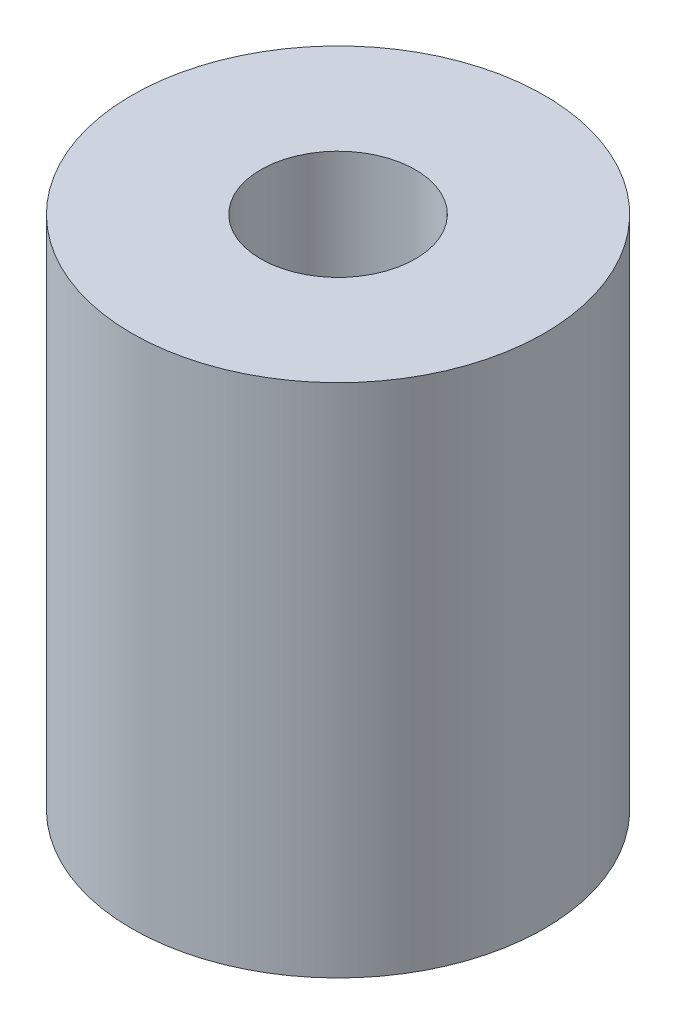
ISO-10303-21;
HEADER;
FILE_DESCRIPTION(('STEP AP214'),'2;1');
FILE_NAME('part.step','',(''),(''),'','','');
FILE_SCHEMA(('AUTOMOTIVE_DESIGN { 1 0 10303 214 1 1 1 1 }'));
ENDSEC;
DATA;
#1=APPLICATION_CONTEXT('core data for automotive mechanical design processes');
#2=APPLICATION_PROTOCOL_DEFINITION('international standard','automotive_design',2000,#1);
#3=PRODUCT_CONTEXT('',#1,'mechanical');
#4=PRODUCT('Part','Part','',(#3));
#5=PRODUCT_RELATED_PRODUCT_CATEGORY('part','',(#4));
#6=PRODUCT_DEFINITION_FORMATION('','',#4);
#7=PRODUCT_DEFINITION_CONTEXT('part definition',#1,'design');
#8=PRODUCT_DEFINITION('design','',#6,#7);
#9=PRODUCT_DEFINITION_SHAPE('','',#8);
#10=(LENGTH_UNIT() NAMED_UNIT(*) SI_UNIT(.MILLI.,.METRE.));
#11=(NAMED_UNIT(*) PLANE_ANGLE_UNIT() SI_UNIT($,.RADIAN.));
#12=(NAMED_UNIT(*) SI_UNIT($,.STERADIAN.) SOLID_ANGLE_UNIT());
#13=UNCERTAINTY_MEASURE_WITH_UNIT(LENGTH_MEASURE(1.E-05),#10,'distance_accuracy_value','');
#14=(GEOMETRIC_REPRESENTATION_CONTEXT(3) GLOBAL_UNCERTAINTY_ASSIGNED_CONTEXT((#13)) GLOBAL_UNIT_ASSIGNED_CONTEXT((#10,
#11,#12)) REPRESENTATION_CONTEXT('',''));
#15=CARTESIAN_POINT('',(0.,0.,0.));
#16=DIRECTION('',(0.,0.,1.));
#17=DIRECTION('',(1.,0.,0.));
#18=AXIS2_PLACEMENT_3D('',#15,#16,#17);
#19=CARTESIAN_POINT('',(0.,10.,0.));
#20=DIRECTION('',(0.,1.,0.));
#21=DIRECTION('',(0.,0.,1.));
#22=AXIS2_PLACEMENT_3D('',#19,#20,#21);
#23=PLANE('',#22);
#24=CARTESIAN_POINT('',(0.,10.,0.));
#25=DIRECTION('',(0.,1.,0.));
#26=DIRECTION('',(0.,0.,1.));
#27=AXIS2_PLACEMENT_3D('',#24,#25,#26);
#28=CIRCLE('',#27,4.);
#29=CARTESIAN_POINT('',(0.,10.,4.));
#30=VERTEX_POINT('',#29);
#31=EDGE_CURVE('E10',#30,#30,#28,.T.);
#32=ORIENTED_EDGE('',*,*,#31,.T.);
#33=EDGE_LOOP('',(#32));
#34=FACE_BOUND('',#33,.T.);
#35=CARTESIAN_POINT('',(0.,10.,0.));
#36=DIRECTION('',(0.,1.,0.));
#37=DIRECTION('',(0.,0.,1.));
#38=AXIS2_PLACEMENT_3D('',#35,#36,#37);
#39=CIRCLE('',#38,1.5);
#40=CARTESIAN_POINT('',(0.,10.,1.5));
#41=VERTEX_POINT('',#40);
#42=EDGE_CURVE('E41',#41,#41,#39,.T.);
#43=ORIENTED_EDGE('',*,*,#42,.F.);
#44=EDGE_LOOP('',(#43));
#45=FACE_BOUND('',#44,.T.);
#46=ADVANCED_FACE('F30',(#34,#45),#23,.T.);
#47=CARTESIAN_POINT('',(0.,0.,0.));
#48=DIRECTION('',(0.,1.,0.));
#49=DIRECTION('',(0.,0.,1.));
#50=AXIS2_PLACEMENT_3D('',#47,#48,#49);
#51=PLANE('',#50);
#52=CARTESIAN_POINT('',(0.,0.,0.));
#53=DIRECTION('',(0.,1.,0.));
#54=DIRECTION('',(0.,0.,1.));
#55=AXIS2_PLACEMENT_3D('',#52,#53,#54);
#56=CIRCLE('',#55,4.);
#57=CARTESIAN_POINT('',(0.,0.,4.));
#58=VERTEX_POINT('',#57);
#59=EDGE_CURVE('E34',#58,#58,#56,.T.);
#60=ORIENTED_EDGE('',*,*,#59,.F.);
#61=EDGE_LOOP('',(#60));
#62=FACE_BOUND('',#61,.T.);
#63=CARTESIAN_POINT('',(0.,0.,0.));
#64=DIRECTION('',(0.,1.,0.));
#65=DIRECTION('',(0.,0.,1.));
#66=AXIS2_PLACEMENT_3D('',#63,#64,#65);
#67=CIRCLE('',#66,1.5);
#68=CARTESIAN_POINT('',(0.,0.,1.5));
#69=VERTEX_POINT('',#68);
#70=EDGE_CURVE('E43',#69,#69,#67,.T.);
#71=ORIENTED_EDGE('',*,*,#70,.T.);
#72=EDGE_LOOP('',(#71));
#73=FACE_BOUND('',#72,.T.);
#74=ADVANCED_FACE('F53',(#62,#73),#51,.F.);
#75=CARTESIAN_POINT('',(0.,10.,0.));
#76=DIRECTION('',(0.,-1.,0.));
#77=DIRECTION('',(0.,0.,-1.));
#78=AXIS2_PLACEMENT_3D('',#75,#76,#77);
#79=CYLINDRICAL_SURFACE('',#78,4.);
#80=ORIENTED_EDGE('',*,*,#31,.F.);
#81=EDGE_LOOP('',(#80));
#82=FACE_BOUND('',#81,.T.);
#83=ORIENTED_EDGE('',*,*,#59,.T.);
#84=EDGE_LOOP('',(#83));
#85=FACE_BOUND('',#84,.T.);
#86=ADVANCED_FACE('F32',(#82,#85),#79,.T.);
#87=CARTESIAN_POINT('',(0.,10.,0.));
#88=DIRECTION('',(0.,-1.,0.));
#89=DIRECTION('',(0.,0.,-1.));
#90=AXIS2_PLACEMENT_3D('',#87,#88,#89);
#91=CYLINDRICAL_SURFACE('',#90,1.5);
#92=ORIENTED_EDGE('',*,*,#42,.T.);
#93=EDGE_LOOP('',(#92));
#94=FACE_BOUND('',#93,.T.);
#95=ORIENTED_EDGE('',*,*,#70,.F.);
#96=EDGE_LOOP('',(#95));
#97=FACE_BOUND('',#96,.T.);
#98=ADVANCED_FACE('F49',(#94,#97),#91,.F.);
#99=CLOSED_SHELL('',(#46,#74,#86,#98));
#100=MANIFOLD_SOLID_BREP('B2',#99);
#101=ADVANCED_BREP_SHAPE_REPRESENTATION('',(#18,#100),#14);
#102=SHAPE_DEFINITION_REPRESENTATION(#9,#101);
ENDSEC;
END-ISO-10303-21;
